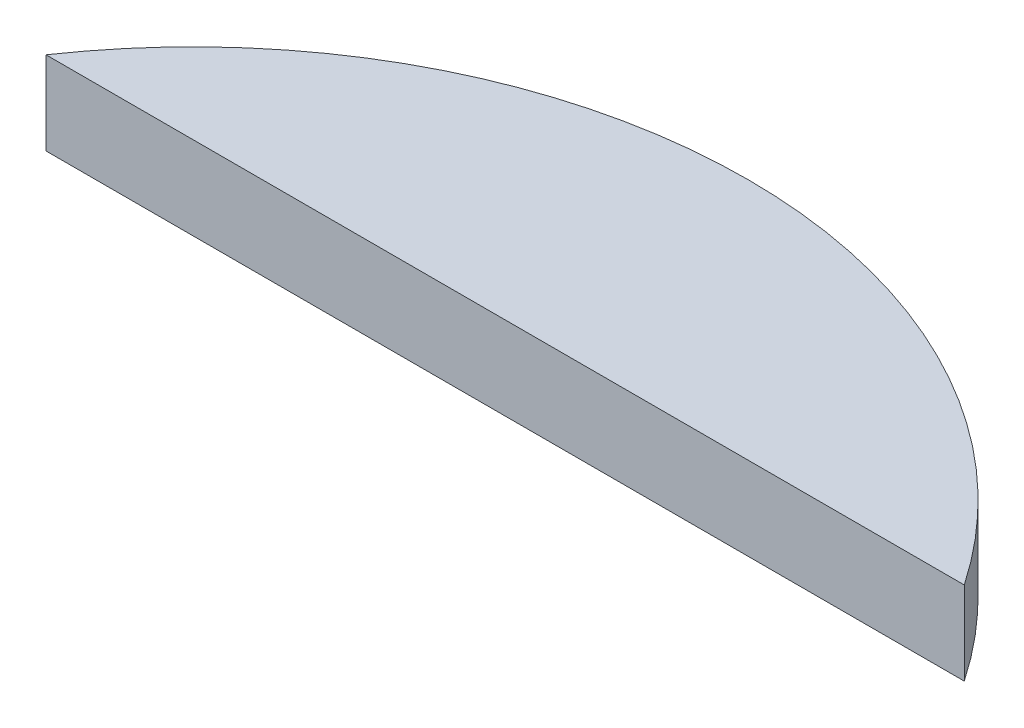
ISO-10303-21;
HEADER;
FILE_DESCRIPTION(('STEP AP214'),'2;1');
FILE_NAME('part.step','',(''),(''),'','','');
FILE_SCHEMA(('AUTOMOTIVE_DESIGN { 1 0 10303 214 1 1 1 1 }'));
ENDSEC;
DATA;
#1=APPLICATION_CONTEXT('core data for automotive mechanical design processes');
#2=APPLICATION_PROTOCOL_DEFINITION('international standard','automotive_design',2000,#1);
#3=PRODUCT_CONTEXT('',#1,'mechanical');
#4=PRODUCT('Part','Part','',(#3));
#5=PRODUCT_RELATED_PRODUCT_CATEGORY('part','',(#4));
#6=PRODUCT_DEFINITION_FORMATION('','',#4);
#7=PRODUCT_DEFINITION_CONTEXT('part definition',#1,'design');
#8=PRODUCT_DEFINITION('design','',#6,#7);
#9=PRODUCT_DEFINITION_SHAPE('','',#8);
#10=(LENGTH_UNIT() NAMED_UNIT(*) SI_UNIT(.MILLI.,.METRE.));
#11=(NAMED_UNIT(*) PLANE_ANGLE_UNIT() SI_UNIT($,.RADIAN.));
#12=(NAMED_UNIT(*) SI_UNIT($,.STERADIAN.) SOLID_ANGLE_UNIT());
#13=UNCERTAINTY_MEASURE_WITH_UNIT(LENGTH_MEASURE(1.E-05),#10,'distance_accuracy_value','');
#14=(GEOMETRIC_REPRESENTATION_CONTEXT(3) GLOBAL_UNCERTAINTY_ASSIGNED_CONTEXT((#13)) GLOBAL_UNIT_ASSIGNED_CONTEXT((#10,
#11,#12)) REPRESENTATION_CONTEXT('',''));
#15=CARTESIAN_POINT('',(0.,0.,0.));
#16=DIRECTION('',(0.,0.,1.));
#17=DIRECTION('',(1.,0.,0.));
#18=AXIS2_PLACEMENT_3D('',#15,#16,#17);
#19=CARTESIAN_POINT('',(0.,-23.,7.62499996274701));
#20=DIRECTION('',(0.,1.,0.));
#21=DIRECTION('',(0.,0.,1.));
#22=AXIS2_PLACEMENT_3D('',#19,#20,#21);
#23=PLANE('',#22);
#24=DIRECTION('',(-1.,0.,0.));
#25=VECTOR('',#24,1.);
#26=CARTESIAN_POINT('',(2.01227923213309E-13,-22.9999997619144,-11.2500000000001));
#27=LINE('',#26,#25);
#28=CARTESIAN_POINT('',(16.535945784273,-22.9999997619144,-11.2499999999921));
#29=VERTEX_POINT('',#28);
#30=CARTESIAN_POINT('',(-16.5359457842628,-22.9999997619144,-11.2500000000067));
#31=VERTEX_POINT('',#30);
#32=EDGE_CURVE('E40',#29,#31,#27,.T.);
#33=ORIENTED_EDGE('',*,*,#32,.T.);
#34=CARTESIAN_POINT('',(1.16573417585641E-13,-22.9999997619144,0.));
#35=DIRECTION('',(0.,-1.,0.));
#36=DIRECTION('',(0.,0.,-1.));
#37=AXIS2_PLACEMENT_3D('',#34,#35,#36);
#38=CIRCLE('',#37,20.0000000745058);
#39=EDGE_CURVE('E20',#29,#31,#38,.F.);
#40=ORIENTED_EDGE('',*,*,#39,.F.);
#41=EDGE_LOOP('',(#33,#40));
#42=FACE_BOUND('',#41,.T.);
#43=ADVANCED_FACE('F17',(#42),#23,.F.);
#44=CARTESIAN_POINT('',(2.01227923213309E-13,-30.5433363392091,-11.2500000000001));
#45=DIRECTION('',(0.,0.,-1.));
#46=DIRECTION('',(-1.,0.,0.));
#47=AXIS2_PLACEMENT_3D('',#44,#45,#46);
#48=PLANE('',#47);
#49=DIRECTION('',(1.,0.,0.));
#50=VECTOR('',#49,1.);
#51=CARTESIAN_POINT('',(0.,-20.,-11.2500000000002));
#52=LINE('',#51,#50);
#53=CARTESIAN_POINT('',(-16.5359457842628,-20.,-11.2500000000067));
#54=VERTEX_POINT('',#53);
#55=CARTESIAN_POINT('',(16.5359457842729,-20.,-11.2499999999922));
#56=VERTEX_POINT('',#55);
#57=EDGE_CURVE('E26',#54,#56,#52,.T.);
#58=ORIENTED_EDGE('',*,*,#57,.F.);
#59=DIRECTION('',(0.,-1.,0.));
#60=VECTOR('',#59,1.);
#61=CARTESIAN_POINT('',(-16.5359457842583,-20.,-11.2500000000133));
#62=LINE('',#61,#60);
#63=EDGE_CURVE('E46',#31,#54,#62,.F.);
#64=ORIENTED_EDGE('',*,*,#63,.F.);
#65=ORIENTED_EDGE('',*,*,#32,.F.);
#66=DIRECTION('',(0.,-1.,0.));
#67=VECTOR('',#66,1.);
#68=CARTESIAN_POINT('',(16.5359457842783,-20.,-11.2499999999842));
#69=LINE('',#68,#67);
#70=EDGE_CURVE('E34',#56,#29,#69,.T.);
#71=ORIENTED_EDGE('',*,*,#70,.F.);
#72=EDGE_LOOP('',(#58,#64,#65,#71));
#73=FACE_BOUND('',#72,.T.);
#74=ADVANCED_FACE('F47',(#73),#48,.F.);
#75=CARTESIAN_POINT('',(1.16573417585641E-13,-20.,0.));
#76=DIRECTION('',(0.,-1.,0.));
#77=DIRECTION('',(0.,0.,-1.));
#78=AXIS2_PLACEMENT_3D('',#75,#76,#77);
#79=CYLINDRICAL_SURFACE('',#78,20.0000000745058);
#80=ORIENTED_EDGE('',*,*,#63,.T.);
#81=CARTESIAN_POINT('',(1.16573417585641E-13,-20.,0.));
#82=DIRECTION('',(0.,-1.,0.));
#83=DIRECTION('',(0.,0.,-1.));
#84=AXIS2_PLACEMENT_3D('',#81,#82,#83);
#85=CIRCLE('',#84,20.0000000745058);
#86=EDGE_CURVE('E11',#56,#54,#85,.F.);
#87=ORIENTED_EDGE('',*,*,#86,.F.);
#88=ORIENTED_EDGE('',*,*,#70,.T.);
#89=ORIENTED_EDGE('',*,*,#39,.T.);
#90=EDGE_LOOP('',(#80,#87,#88,#89));
#91=FACE_BOUND('',#90,.T.);
#92=ADVANCED_FACE('F51',(#91),#79,.T.);
#93=CARTESIAN_POINT('',(0.,-20.,7.62499996274701));
#94=DIRECTION('',(0.,1.,0.));
#95=DIRECTION('',(0.,0.,1.));
#96=AXIS2_PLACEMENT_3D('',#93,#94,#95);
#97=PLANE('',#96);
#98=ORIENTED_EDGE('',*,*,#57,.T.);
#99=ORIENTED_EDGE('',*,*,#86,.T.);
#100=EDGE_LOOP('',(#98,#99));
#101=FACE_BOUND('',#100,.T.);
#102=ADVANCED_FACE('F55',(#101),#97,.T.);
#103=CLOSED_SHELL('',(#43,#74,#92,#102));
#104=MANIFOLD_SOLID_BREP('B1',#103);
#105=ADVANCED_BREP_SHAPE_REPRESENTATION('',(#18,#104),#14);
#106=SHAPE_DEFINITION_REPRESENTATION(#9,#105);
ENDSEC;
END-ISO-10303-21;
